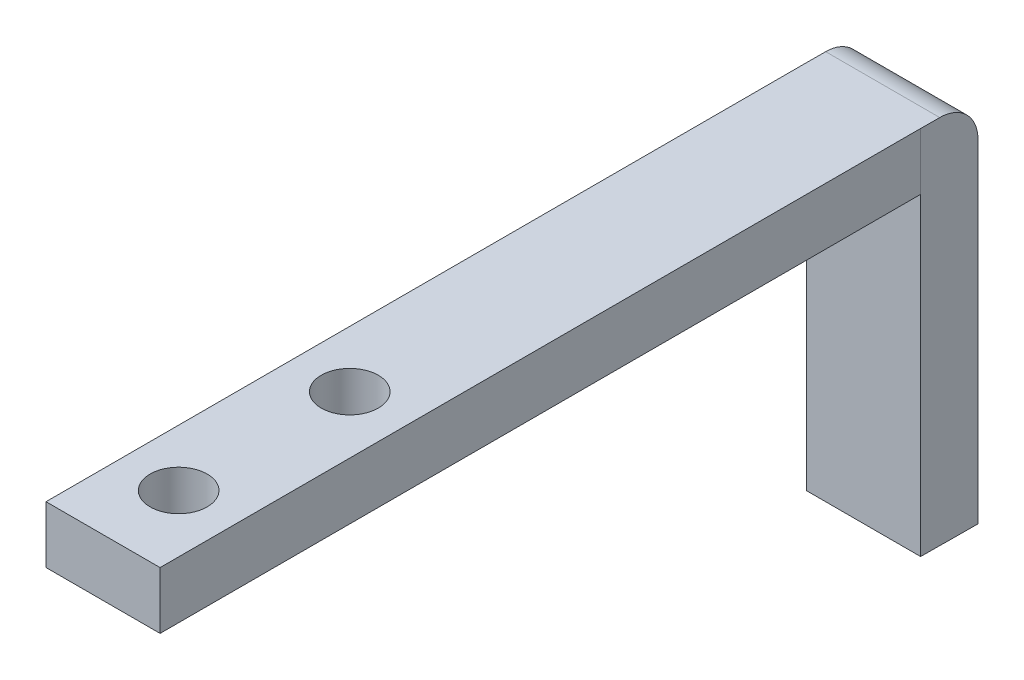
ISO-10303-21;
HEADER;
FILE_DESCRIPTION(('STEP AP214'),'2;1');
FILE_NAME('part.step','',(''),(''),'','','');
FILE_SCHEMA(('AUTOMOTIVE_DESIGN { 1 0 10303 214 1 1 1 1 }'));
ENDSEC;
DATA;
#1=APPLICATION_CONTEXT('core data for automotive mechanical design processes');
#2=APPLICATION_PROTOCOL_DEFINITION('international standard','automotive_design',2000,#1);
#3=PRODUCT_CONTEXT('',#1,'mechanical');
#4=PRODUCT('Part','Part','',(#3));
#5=PRODUCT_RELATED_PRODUCT_CATEGORY('part','',(#4));
#6=PRODUCT_DEFINITION_FORMATION('','',#4);
#7=PRODUCT_DEFINITION_CONTEXT('part definition',#1,'design');
#8=PRODUCT_DEFINITION('design','',#6,#7);
#9=PRODUCT_DEFINITION_SHAPE('','',#8);
#10=(LENGTH_UNIT() NAMED_UNIT(*) SI_UNIT(.MILLI.,.METRE.));
#11=(NAMED_UNIT(*) PLANE_ANGLE_UNIT() SI_UNIT($,.RADIAN.));
#12=(NAMED_UNIT(*) SI_UNIT($,.STERADIAN.) SOLID_ANGLE_UNIT());
#13=UNCERTAINTY_MEASURE_WITH_UNIT(LENGTH_MEASURE(1.E-05),#10,'distance_accuracy_value','');
#14=(GEOMETRIC_REPRESENTATION_CONTEXT(3) GLOBAL_UNCERTAINTY_ASSIGNED_CONTEXT((#13)) GLOBAL_UNIT_ASSIGNED_CONTEXT((#10,
#11,#12)) REPRESENTATION_CONTEXT('',''));
#15=CARTESIAN_POINT('',(0.,0.,0.));
#16=DIRECTION('',(0.,0.,1.));
#17=DIRECTION('',(1.,0.,0.));
#18=AXIS2_PLACEMENT_3D('',#15,#16,#17);
#19=CARTESIAN_POINT('',(20.5408957415697,9.99999999999999,-0.999999999999976));
#20=DIRECTION('',(-0.999983644400858,0.,-0.00571934705874876));
#21=DIRECTION('',(-0.00571934705874877,0.,0.999983644400858));
#22=AXIS2_PLACEMENT_3D('',#19,#20,#21);
#23=PLANE('',#22);
#24=DIRECTION('',(0.00571934705874877,0.,-0.999983644400858));
#25=VECTOR('',#24,1.);
#26=CARTESIAN_POINT('',(20.5408957415697,9.99999999999999,-0.999999999999976));
#27=LINE('',#26,#25);
#28=CARTESIAN_POINT('',(20.5237374197588,9.99999999999999,2.00000000000002));
#29=VERTEX_POINT('',#28);
#30=CARTESIAN_POINT('',(20.5294568603625,9.99999999999999,1.00000000000003));
#31=VERTEX_POINT('',#30);
#32=EDGE_CURVE('E129',#29,#31,#27,.T.);
#33=ORIENTED_EDGE('',*,*,#32,.T.);
#34=CARTESIAN_POINT('',(20.5294568603625,8.,1.00000000000002));
#35=DIRECTION('',(-0.999983644400858,0.,-0.00571934705874876));
#36=DIRECTION('',(0.00571934705874877,0.,-0.999983644400858));
#37=AXIS2_PLACEMENT_3D('',#34,#35,#36);
#38=ELLIPSE('',#37,2.0000327117333,2.);
#39=CARTESIAN_POINT('',(20.5408957415697,8.,-0.999999999999976));
#40=VERTEX_POINT('',#39);
#41=EDGE_CURVE('E11',#31,#40,#38,.T.);
#42=ORIENTED_EDGE('',*,*,#41,.T.);
#43=DIRECTION('',(0.,-1.,0.));
#44=VECTOR('',#43,1.);
#45=CARTESIAN_POINT('',(20.5408957415697,9.99999999999999,-0.999999999999976));
#46=LINE('',#45,#44);
#47=CARTESIAN_POINT('',(20.5408957415697,-9.50000000000001,-0.999999999999976));
#48=VERTEX_POINT('',#47);
#49=EDGE_CURVE('E133',#40,#48,#46,.T.);
#50=ORIENTED_EDGE('',*,*,#49,.T.);
#51=DIRECTION('',(0.00571934705874877,0.,-0.999983644400858));
#52=VECTOR('',#51,1.);
#53=CARTESIAN_POINT('',(20.5408957415697,-9.50000000000001,-0.999999999999976));
#54=LINE('',#53,#52);
#55=CARTESIAN_POINT('',(20.5237374197588,-9.50000000000001,2.00000000000002));
#56=VERTEX_POINT('',#55);
#57=EDGE_CURVE('E120',#56,#48,#54,.T.);
#58=ORIENTED_EDGE('',*,*,#57,.F.);
#59=DIRECTION('',(0.,-1.,0.));
#60=VECTOR('',#59,1.);
#61=CARTESIAN_POINT('',(20.5237374197588,9.99999999999999,2.00000000000002));
#62=LINE('',#61,#60);
#63=CARTESIAN_POINT('',(20.5237374197588,6.99999999999999,2.00000000000002));
#64=VERTEX_POINT('',#63);
#65=EDGE_CURVE('E146',#64,#56,#62,.T.);
#66=ORIENTED_EDGE('',*,*,#65,.F.);
#67=EDGE_CURVE('E142',#29,#64,#62,.T.);
#68=ORIENTED_EDGE('',*,*,#67,.F.);
#69=EDGE_LOOP('',(#33,#42,#50,#58,#66,#68));
#70=FACE_BOUND('',#69,.T.);
#71=ADVANCED_FACE('F33',(#70),#23,.T.);
#72=CARTESIAN_POINT('',(20.5237374197588,9.99999999999999,2.00000000000002));
#73=DIRECTION('',(0.,0.,1.));
#74=DIRECTION('',(1.,0.,0.));
#75=AXIS2_PLACEMENT_3D('',#72,#73,#74);
#76=PLANE('',#75);
#77=DIRECTION('',(1.,0.,0.));
#78=VECTOR('',#77,1.);
#79=CARTESIAN_POINT('',(26.5238355549588,6.99999999999999,2.00000000000002));
#80=LINE('',#79,#78);
#81=CARTESIAN_POINT('',(26.5238355549588,6.99999999999999,2.00000000000002));
#82=VERTEX_POINT('',#81);
#83=EDGE_CURVE('E116',#64,#82,#80,.T.);
#84=ORIENTED_EDGE('',*,*,#83,.F.);
#85=ORIENTED_EDGE('',*,*,#65,.T.);
#86=DIRECTION('',(-1.,0.,0.));
#87=VECTOR('',#86,1.);
#88=CARTESIAN_POINT('',(20.5237374197588,-9.50000000000001,2.00000000000002));
#89=LINE('',#88,#87);
#90=CARTESIAN_POINT('',(26.5238355549588,-9.50000000000001,2.00000000000002));
#91=VERTEX_POINT('',#90);
#92=EDGE_CURVE('E132',#91,#56,#89,.T.);
#93=ORIENTED_EDGE('',*,*,#92,.F.);
#94=DIRECTION('',(0.,-1.,0.));
#95=VECTOR('',#94,1.);
#96=CARTESIAN_POINT('',(26.5238355549588,9.99999999999999,2.00000000000002));
#97=LINE('',#96,#95);
#98=EDGE_CURVE('E148',#82,#91,#97,.T.);
#99=ORIENTED_EDGE('',*,*,#98,.F.);
#100=EDGE_LOOP('',(#84,#85,#93,#99));
#101=FACE_BOUND('',#100,.T.);
#102=ADVANCED_FACE('F182',(#101),#76,.T.);
#103=CARTESIAN_POINT('',(26.5409938767696,9.99999999999999,-0.999999999999976));
#104=DIRECTION('',(0.999983644400858,0.,0.00571934705874876));
#105=DIRECTION('',(0.00571934705874877,0.,-0.999983644400858));
#106=AXIS2_PLACEMENT_3D('',#103,#104,#105);
#107=PLANE('',#106);
#108=DIRECTION('',(0.,-1.,0.));
#109=VECTOR('',#108,1.);
#110=CARTESIAN_POINT('',(26.5409938767696,9.99999999999999,-0.999999999999976));
#111=LINE('',#110,#109);
#112=CARTESIAN_POINT('',(26.5409938767696,7.99999999999999,-0.999999999999976));
#113=VERTEX_POINT('',#112);
#114=CARTESIAN_POINT('',(26.5409938767696,-9.50000000000001,-0.999999999999976));
#115=VERTEX_POINT('',#114);
#116=EDGE_CURVE('E149',#113,#115,#111,.T.);
#117=ORIENTED_EDGE('',*,*,#116,.F.);
#118=CARTESIAN_POINT('',(26.5295549955624,7.99999999999999,1.00000000000002));
#119=DIRECTION('',(0.999983644400858,0.,0.00571934705874876));
#120=DIRECTION('',(0.00571934705874877,0.,-0.999983644400858));
#121=AXIS2_PLACEMENT_3D('',#118,#119,#120);
#122=ELLIPSE('',#121,2.0000327117333,2.);
#123=CARTESIAN_POINT('',(26.5295549955624,9.99999999999999,1.00000000000003));
#124=VERTEX_POINT('',#123);
#125=EDGE_CURVE('E55',#113,#124,#122,.T.);
#126=ORIENTED_EDGE('',*,*,#125,.T.);
#127=DIRECTION('',(-0.00571934705874877,0.,0.999983644400858));
#128=VECTOR('',#127,1.);
#129=CARTESIAN_POINT('',(26.5409938767696,9.99999999999999,-0.999999999999976));
#130=LINE('',#129,#128);
#131=CARTESIAN_POINT('',(26.5238355549588,9.99999999999999,2.00000000000002));
#132=VERTEX_POINT('',#131);
#133=EDGE_CURVE('E131',#124,#132,#130,.T.);
#134=ORIENTED_EDGE('',*,*,#133,.T.);
#135=EDGE_CURVE('E119',#132,#82,#97,.T.);
#136=ORIENTED_EDGE('',*,*,#135,.T.);
#137=ORIENTED_EDGE('',*,*,#98,.T.);
#138=DIRECTION('',(-0.00571934705874877,0.,0.999983644400858));
#139=VECTOR('',#138,1.);
#140=CARTESIAN_POINT('',(26.5409938767696,-9.50000000000001,-0.999999999999976));
#141=LINE('',#140,#139);
#142=EDGE_CURVE('E137',#115,#91,#141,.T.);
#143=ORIENTED_EDGE('',*,*,#142,.F.);
#144=EDGE_LOOP('',(#117,#126,#134,#136,#137,#143));
#145=FACE_BOUND('',#144,.T.);
#146=ADVANCED_FACE('F162',(#145),#107,.T.);
#147=CARTESIAN_POINT('',(20.5408957415697,9.99999999999999,-0.999999999999976));
#148=DIRECTION('',(0.,0.,-1.));
#149=DIRECTION('',(-1.,0.,0.));
#150=AXIS2_PLACEMENT_3D('',#147,#148,#149);
#151=PLANE('',#150);
#152=ORIENTED_EDGE('',*,*,#49,.F.);
#153=DIRECTION('',(1.,0.,0.));
#154=VECTOR('',#153,1.);
#155=CARTESIAN_POINT('',(20.5408957415697,8.,-0.999999999999976));
#156=LINE('',#155,#154);
#157=EDGE_CURVE('E145',#40,#113,#156,.T.);
#158=ORIENTED_EDGE('',*,*,#157,.T.);
#159=ORIENTED_EDGE('',*,*,#116,.T.);
#160=DIRECTION('',(1.,0.,0.));
#161=VECTOR('',#160,1.);
#162=CARTESIAN_POINT('',(20.5408957415697,-9.50000000000001,-0.999999999999976));
#163=LINE('',#162,#161);
#164=EDGE_CURVE('E123',#48,#115,#163,.T.);
#165=ORIENTED_EDGE('',*,*,#164,.F.);
#166=EDGE_LOOP('',(#152,#158,#159,#165));
#167=FACE_BOUND('',#166,.T.);
#168=ADVANCED_FACE('F157',(#167),#151,.T.);
#169=CARTESIAN_POINT('',(0.,10.,0.));
#170=DIRECTION('',(0.,1.,0.));
#171=DIRECTION('',(-1.,0.,0.));
#172=AXIS2_PLACEMENT_3D('',#169,#170,#171);
#173=PLANE('',#172);
#174=CARTESIAN_POINT('',(23.4999999999887,10.,38.));
#175=DIRECTION('',(0.,-1.,0.));
#176=DIRECTION('',(1.,0.,0.));
#177=AXIS2_PLACEMENT_3D('',#174,#175,#176);
#178=CIRCLE('',#177,1.5);
#179=CARTESIAN_POINT('',(24.9999999999887,10.,38.));
#180=VERTEX_POINT('',#179);
#181=EDGE_CURVE('E214',#180,#180,#178,.T.);
#182=ORIENTED_EDGE('',*,*,#181,.T.);
#183=EDGE_LOOP('',(#182));
#184=FACE_BOUND('',#183,.T.);
#185=CARTESIAN_POINT('',(23.4999999999887,10.,29.));
#186=DIRECTION('',(0.,-1.,0.));
#187=DIRECTION('',(1.,0.,0.));
#188=AXIS2_PLACEMENT_3D('',#185,#186,#187);
#189=CIRCLE('',#188,1.5);
#190=CARTESIAN_POINT('',(24.9999999999887,10.,29.));
#191=VERTEX_POINT('',#190);
#192=EDGE_CURVE('E218',#191,#191,#189,.T.);
#193=ORIENTED_EDGE('',*,*,#192,.T.);
#194=EDGE_LOOP('',(#193));
#195=FACE_BOUND('',#194,.T.);
#196=ORIENTED_EDGE('',*,*,#133,.F.);
#197=DIRECTION('',(1.,0.,0.));
#198=VECTOR('',#197,1.);
#199=CARTESIAN_POINT('',(0.,10.,1.00000000000002));
#200=LINE('',#199,#198);
#201=EDGE_CURVE('E41',#124,#31,#200,.F.);
#202=ORIENTED_EDGE('',*,*,#201,.T.);
#203=ORIENTED_EDGE('',*,*,#32,.F.);
#204=DIRECTION('',(0.,0.,-1.));
#205=VECTOR('',#204,1.);
#206=CARTESIAN_POINT('',(20.5237374197588,9.99999999999999,42.));
#207=LINE('',#206,#205);
#208=CARTESIAN_POINT('',(20.5237374197588,9.99999999999999,42.));
#209=VERTEX_POINT('',#208);
#210=EDGE_CURVE('E103',#209,#29,#207,.T.);
#211=ORIENTED_EDGE('',*,*,#210,.F.);
#212=DIRECTION('',(-1.,0.,0.));
#213=VECTOR('',#212,1.);
#214=CARTESIAN_POINT('',(26.5238355549588,9.99999999999999,42.));
#215=LINE('',#214,#213);
#216=CARTESIAN_POINT('',(26.5238355549588,9.99999999999999,42.));
#217=VERTEX_POINT('',#216);
#218=EDGE_CURVE('E96',#217,#209,#215,.T.);
#219=ORIENTED_EDGE('',*,*,#218,.F.);
#220=DIRECTION('',(0.,0.,-1.));
#221=VECTOR('',#220,1.);
#222=CARTESIAN_POINT('',(26.5238355549588,9.99999999999999,42.));
#223=LINE('',#222,#221);
#224=EDGE_CURVE('E100',#217,#132,#223,.T.);
#225=ORIENTED_EDGE('',*,*,#224,.T.);
#226=EDGE_LOOP('',(#196,#202,#203,#211,#219,#225));
#227=FACE_BOUND('',#226,.T.);
#228=ADVANCED_FACE('F98',(#184,#195,#227),#173,.T.);
#229=CARTESIAN_POINT('',(0.,-9.5,0.));
#230=DIRECTION('',(0.,1.,0.));
#231=DIRECTION('',(-1.,0.,0.));
#232=AXIS2_PLACEMENT_3D('',#229,#230,#231);
#233=PLANE('',#232);
#234=ORIENTED_EDGE('',*,*,#57,.T.);
#235=ORIENTED_EDGE('',*,*,#164,.T.);
#236=ORIENTED_EDGE('',*,*,#142,.T.);
#237=ORIENTED_EDGE('',*,*,#92,.T.);
#238=EDGE_LOOP('',(#234,#235,#236,#237));
#239=FACE_BOUND('',#238,.T.);
#240=ADVANCED_FACE('F166',(#239),#233,.F.);
#241=CARTESIAN_POINT('',(26.5238355549588,9.99999999999999,42.));
#242=DIRECTION('',(-1.,0.,0.));
#243=DIRECTION('',(0.,0.,1.));
#244=AXIS2_PLACEMENT_3D('',#241,#242,#243);
#245=PLANE('',#244);
#246=ORIENTED_EDGE('',*,*,#135,.F.);
#247=ORIENTED_EDGE('',*,*,#224,.F.);
#248=DIRECTION('',(0.,1.,0.));
#249=VECTOR('',#248,1.);
#250=CARTESIAN_POINT('',(26.5238355549588,9.99999999999999,42.));
#251=LINE('',#250,#249);
#252=CARTESIAN_POINT('',(26.5238355549588,6.99999999999999,42.));
#253=VERTEX_POINT('',#252);
#254=EDGE_CURVE('E107',#253,#217,#251,.T.);
#255=ORIENTED_EDGE('',*,*,#254,.F.);
#256=DIRECTION('',(0.,0.,-1.));
#257=VECTOR('',#256,1.);
#258=CARTESIAN_POINT('',(26.5238355549588,6.99999999999999,42.));
#259=LINE('',#258,#257);
#260=EDGE_CURVE('E229',#253,#82,#259,.T.);
#261=ORIENTED_EDGE('',*,*,#260,.T.);
#262=EDGE_LOOP('',(#246,#247,#255,#261));
#263=FACE_BOUND('',#262,.T.);
#264=ADVANCED_FACE('F118',(#263),#245,.F.);
#265=CARTESIAN_POINT('',(20.5237374197588,9.99999999999999,42.));
#266=DIRECTION('',(1.,0.,0.));
#267=DIRECTION('',(0.,0.,-1.));
#268=AXIS2_PLACEMENT_3D('',#265,#266,#267);
#269=PLANE('',#268);
#270=ORIENTED_EDGE('',*,*,#67,.T.);
#271=DIRECTION('',(0.,0.,-1.));
#272=VECTOR('',#271,1.);
#273=CARTESIAN_POINT('',(20.5237374197588,6.99999999999999,42.));
#274=LINE('',#273,#272);
#275=CARTESIAN_POINT('',(20.5237374197588,6.99999999999999,42.));
#276=VERTEX_POINT('',#275);
#277=EDGE_CURVE('E125',#276,#64,#274,.T.);
#278=ORIENTED_EDGE('',*,*,#277,.F.);
#279=DIRECTION('',(0.,-1.,0.));
#280=VECTOR('',#279,1.);
#281=CARTESIAN_POINT('',(20.5237374197588,9.99999999999999,42.));
#282=LINE('',#281,#280);
#283=EDGE_CURVE('E106',#209,#276,#282,.T.);
#284=ORIENTED_EDGE('',*,*,#283,.F.);
#285=ORIENTED_EDGE('',*,*,#210,.T.);
#286=EDGE_LOOP('',(#270,#278,#284,#285));
#287=FACE_BOUND('',#286,.T.);
#288=ADVANCED_FACE('F200',(#287),#269,.F.);
#289=CARTESIAN_POINT('',(26.5238355549588,6.99999999999999,42.));
#290=DIRECTION('',(0.,1.,0.));
#291=DIRECTION('',(-1.,0.,0.));
#292=AXIS2_PLACEMENT_3D('',#289,#290,#291);
#293=PLANE('',#292);
#294=CARTESIAN_POINT('',(23.4999999999887,6.99999999999999,38.));
#295=DIRECTION('',(0.,-1.,0.));
#296=DIRECTION('',(1.,0.,0.));
#297=AXIS2_PLACEMENT_3D('',#294,#295,#296);
#298=CIRCLE('',#297,1.5);
#299=CARTESIAN_POINT('',(24.9999999999887,6.99999999999999,38.));
#300=VERTEX_POINT('',#299);
#301=EDGE_CURVE('E217',#300,#300,#298,.T.);
#302=ORIENTED_EDGE('',*,*,#301,.F.);
#303=EDGE_LOOP('',(#302));
#304=FACE_BOUND('',#303,.T.);
#305=CARTESIAN_POINT('',(23.4999999999887,6.99999999999999,29.));
#306=DIRECTION('',(0.,-1.,0.));
#307=DIRECTION('',(1.,0.,0.));
#308=AXIS2_PLACEMENT_3D('',#305,#306,#307);
#309=CIRCLE('',#308,1.5);
#310=CARTESIAN_POINT('',(24.9999999999887,6.99999999999999,29.));
#311=VERTEX_POINT('',#310);
#312=EDGE_CURVE('E222',#311,#311,#309,.T.);
#313=ORIENTED_EDGE('',*,*,#312,.F.);
#314=EDGE_LOOP('',(#313));
#315=FACE_BOUND('',#314,.T.);
#316=ORIENTED_EDGE('',*,*,#83,.T.);
#317=ORIENTED_EDGE('',*,*,#260,.F.);
#318=DIRECTION('',(1.,0.,0.));
#319=VECTOR('',#318,1.);
#320=CARTESIAN_POINT('',(26.5238355549588,6.99999999999999,42.));
#321=LINE('',#320,#319);
#322=EDGE_CURVE('E112',#276,#253,#321,.T.);
#323=ORIENTED_EDGE('',*,*,#322,.F.);
#324=ORIENTED_EDGE('',*,*,#277,.T.);
#325=EDGE_LOOP('',(#316,#317,#323,#324));
#326=FACE_BOUND('',#325,.T.);
#327=ADVANCED_FACE('F179',(#304,#315,#326),#293,.F.);
#328=CARTESIAN_POINT('',(0.,0.,42.));
#329=DIRECTION('',(0.,0.,-1.));
#330=DIRECTION('',(-1.,0.,0.));
#331=AXIS2_PLACEMENT_3D('',#328,#329,#330);
#332=PLANE('',#331);
#333=ORIENTED_EDGE('',*,*,#254,.T.);
#334=ORIENTED_EDGE('',*,*,#218,.T.);
#335=ORIENTED_EDGE('',*,*,#283,.T.);
#336=ORIENTED_EDGE('',*,*,#322,.T.);
#337=EDGE_LOOP('',(#333,#334,#335,#336));
#338=FACE_BOUND('',#337,.T.);
#339=ADVANCED_FACE('F110',(#338),#332,.F.);
#340=CARTESIAN_POINT('',(20.5408957415697,8.,1.00000000000002));
#341=DIRECTION('',(1.,0.,0.));
#342=DIRECTION('',(0.,1.,0.));
#343=AXIS2_PLACEMENT_3D('',#340,#341,#342);
#344=CYLINDRICAL_SURFACE('',#343,2.);
#345=ORIENTED_EDGE('',*,*,#41,.F.);
#346=ORIENTED_EDGE('',*,*,#201,.F.);
#347=ORIENTED_EDGE('',*,*,#125,.F.);
#348=ORIENTED_EDGE('',*,*,#157,.F.);
#349=EDGE_LOOP('',(#345,#346,#347,#348));
#350=FACE_BOUND('',#349,.T.);
#351=ADVANCED_FACE('F35',(#350),#344,.T.);
#352=CARTESIAN_POINT('',(23.4999999999887,10.,29.));
#353=DIRECTION('',(0.,-1.,0.));
#354=DIRECTION('',(1.,0.,0.));
#355=AXIS2_PLACEMENT_3D('',#352,#353,#354);
#356=CYLINDRICAL_SURFACE('',#355,1.5);
#357=ORIENTED_EDGE('',*,*,#192,.F.);
#358=EDGE_LOOP('',(#357));
#359=FACE_BOUND('',#358,.T.);
#360=ORIENTED_EDGE('',*,*,#312,.T.);
#361=EDGE_LOOP('',(#360));
#362=FACE_BOUND('',#361,.T.);
#363=ADVANCED_FACE('F171',(#359,#362),#356,.F.);
#364=CARTESIAN_POINT('',(23.4999999999887,10.,38.));
#365=DIRECTION('',(0.,-1.,0.));
#366=DIRECTION('',(1.,0.,0.));
#367=AXIS2_PLACEMENT_3D('',#364,#365,#366);
#368=CYLINDRICAL_SURFACE('',#367,1.5);
#369=ORIENTED_EDGE('',*,*,#181,.F.);
#370=EDGE_LOOP('',(#369));
#371=FACE_BOUND('',#370,.T.);
#372=ORIENTED_EDGE('',*,*,#301,.T.);
#373=EDGE_LOOP('',(#372));
#374=FACE_BOUND('',#373,.T.);
#375=ADVANCED_FACE('F176',(#371,#374),#368,.F.);
#376=CLOSED_SHELL('',(#71,#102,#146,#168,#228,#240,#264,#288,#327,#339,#351,#363,#375));
#377=MANIFOLD_SOLID_BREP('B2',#376);
#378=ADVANCED_BREP_SHAPE_REPRESENTATION('',(#18,#377),#14);
#379=SHAPE_DEFINITION_REPRESENTATION(#9,#378);
ENDSEC;
END-ISO-10303-21;
